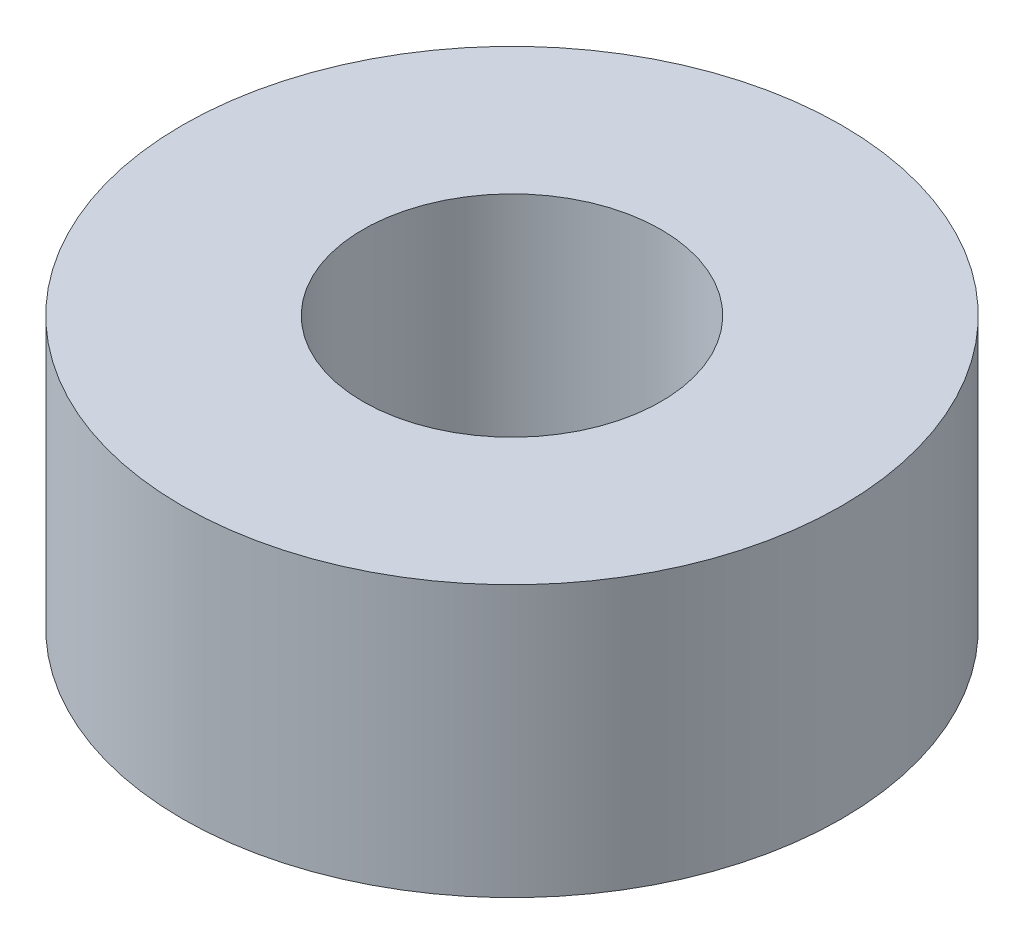
ISO-10303-21;
HEADER;
FILE_DESCRIPTION(('STEP AP214'),'2;1');
FILE_NAME('part.step','',(''),(''),'','','');
FILE_SCHEMA(('AUTOMOTIVE_DESIGN { 1 0 10303 214 1 1 1 1 }'));
ENDSEC;
DATA;
#1=APPLICATION_CONTEXT('core data for automotive mechanical design processes');
#2=APPLICATION_PROTOCOL_DEFINITION('international standard','automotive_design',2000,#1);
#3=PRODUCT_CONTEXT('',#1,'mechanical');
#4=PRODUCT('Part','Part','',(#3));
#5=PRODUCT_RELATED_PRODUCT_CATEGORY('part','',(#4));
#6=PRODUCT_DEFINITION_FORMATION('','',#4);
#7=PRODUCT_DEFINITION_CONTEXT('part definition',#1,'design');
#8=PRODUCT_DEFINITION('design','',#6,#7);
#9=PRODUCT_DEFINITION_SHAPE('','',#8);
#10=(LENGTH_UNIT() NAMED_UNIT(*) SI_UNIT(.MILLI.,.METRE.));
#11=(NAMED_UNIT(*) PLANE_ANGLE_UNIT() SI_UNIT($,.RADIAN.));
#12=(NAMED_UNIT(*) SI_UNIT($,.STERADIAN.) SOLID_ANGLE_UNIT());
#13=UNCERTAINTY_MEASURE_WITH_UNIT(LENGTH_MEASURE(1.E-05),#10,'distance_accuracy_value','');
#14=(GEOMETRIC_REPRESENTATION_CONTEXT(3) GLOBAL_UNCERTAINTY_ASSIGNED_CONTEXT((#13)) GLOBAL_UNIT_ASSIGNED_CONTEXT((#10,
#11,#12)) REPRESENTATION_CONTEXT('',''));
#15=CARTESIAN_POINT('',(0.,0.,0.));
#16=DIRECTION('',(0.,0.,1.));
#17=DIRECTION('',(1.,0.,0.));
#18=AXIS2_PLACEMENT_3D('',#15,#16,#17);
#19=CARTESIAN_POINT('',(0.,3.,0.));
#20=DIRECTION('',(0.,1.,0.));
#21=DIRECTION('',(0.,0.,1.));
#22=AXIS2_PLACEMENT_3D('',#19,#20,#21);
#23=PLANE('',#22);
#24=CARTESIAN_POINT('',(0.,3.,0.));
#25=DIRECTION('',(0.,1.,0.));
#26=DIRECTION('',(0.,0.,1.));
#27=AXIS2_PLACEMENT_3D('',#24,#25,#26);
#28=CIRCLE('',#27,3.65);
#29=CARTESIAN_POINT('',(0.,3.,3.65));
#30=VERTEX_POINT('',#29);
#31=EDGE_CURVE('E10',#30,#30,#28,.T.);
#32=ORIENTED_EDGE('',*,*,#31,.T.);
#33=EDGE_LOOP('',(#32));
#34=FACE_BOUND('',#33,.T.);
#35=CARTESIAN_POINT('',(0.,3.,0.));
#36=DIRECTION('',(0.,1.,0.));
#37=DIRECTION('',(0.,0.,1.));
#38=AXIS2_PLACEMENT_3D('',#35,#36,#37);
#39=CIRCLE('',#38,1.65);
#40=CARTESIAN_POINT('',(0.,3.,1.65));
#41=VERTEX_POINT('',#40);
#42=EDGE_CURVE('E51',#41,#41,#39,.T.);
#43=ORIENTED_EDGE('',*,*,#42,.F.);
#44=EDGE_LOOP('',(#43));
#45=FACE_BOUND('',#44,.T.);
#46=ADVANCED_FACE('F37',(#34,#45),#23,.T.);
#47=CARTESIAN_POINT('',(0.,0.,0.));
#48=DIRECTION('',(0.,1.,0.));
#49=DIRECTION('',(0.,0.,1.));
#50=AXIS2_PLACEMENT_3D('',#47,#48,#49);
#51=PLANE('',#50);
#52=CARTESIAN_POINT('',(0.,0.,0.));
#53=DIRECTION('',(0.,1.,0.));
#54=DIRECTION('',(0.,0.,1.));
#55=AXIS2_PLACEMENT_3D('',#52,#53,#54);
#56=CIRCLE('',#55,3.65);
#57=CARTESIAN_POINT('',(0.,0.,3.65));
#58=VERTEX_POINT('',#57);
#59=EDGE_CURVE('E41',#58,#58,#56,.T.);
#60=ORIENTED_EDGE('',*,*,#59,.F.);
#61=EDGE_LOOP('',(#60));
#62=FACE_BOUND('',#61,.T.);
#63=CARTESIAN_POINT('',(0.,0.,0.));
#64=DIRECTION('',(0.,1.,0.));
#65=DIRECTION('',(0.,0.,1.));
#66=AXIS2_PLACEMENT_3D('',#63,#64,#65);
#67=CIRCLE('',#66,1.65);
#68=CARTESIAN_POINT('',(0.,0.,1.65));
#69=VERTEX_POINT('',#68);
#70=EDGE_CURVE('E53',#69,#69,#67,.T.);
#71=ORIENTED_EDGE('',*,*,#70,.T.);
#72=EDGE_LOOP('',(#71));
#73=FACE_BOUND('',#72,.T.);
#74=ADVANCED_FACE('F64',(#62,#73),#51,.F.);
#75=CARTESIAN_POINT('',(0.,3.,0.));
#76=DIRECTION('',(0.,-1.,0.));
#77=DIRECTION('',(0.,0.,-1.));
#78=AXIS2_PLACEMENT_3D('',#75,#76,#77);
#79=CYLINDRICAL_SURFACE('',#78,3.65);
#80=ORIENTED_EDGE('',*,*,#31,.F.);
#81=EDGE_LOOP('',(#80));
#82=FACE_BOUND('',#81,.T.);
#83=ORIENTED_EDGE('',*,*,#59,.T.);
#84=EDGE_LOOP('',(#83));
#85=FACE_BOUND('',#84,.T.);
#86=ADVANCED_FACE('F39',(#82,#85),#79,.T.);
#87=CARTESIAN_POINT('',(0.,3.,0.));
#88=DIRECTION('',(0.,-1.,0.));
#89=DIRECTION('',(0.,0.,-1.));
#90=AXIS2_PLACEMENT_3D('',#87,#88,#89);
#91=CYLINDRICAL_SURFACE('',#90,1.65);
#92=ORIENTED_EDGE('',*,*,#42,.T.);
#93=EDGE_LOOP('',(#92));
#94=FACE_BOUND('',#93,.T.);
#95=ORIENTED_EDGE('',*,*,#70,.F.);
#96=EDGE_LOOP('',(#95));
#97=FACE_BOUND('',#96,.T.);
#98=ADVANCED_FACE('F60',(#94,#97),#91,.F.);
#99=CLOSED_SHELL('',(#46,#74,#86,#98));
#100=MANIFOLD_SOLID_BREP('B2',#99);
#101=ADVANCED_BREP_SHAPE_REPRESENTATION('',(#18,#100),#14);
#102=SHAPE_DEFINITION_REPRESENTATION(#9,#101);
ENDSEC;
END-ISO-10303-21;
